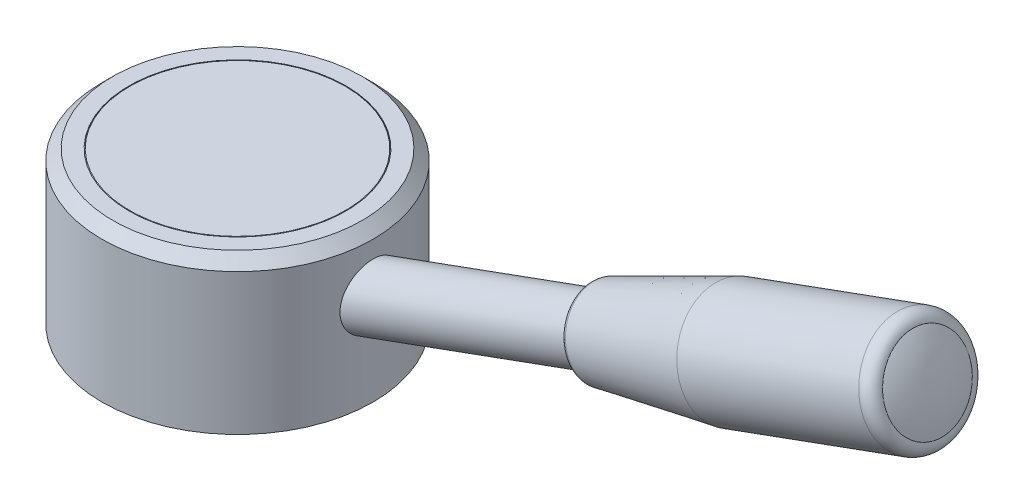
ISO-10303-21;
HEADER;
FILE_DESCRIPTION(('STEP AP214'),'2;1');
FILE_NAME('part.step','',(''),(''),'','','');
FILE_SCHEMA(('AUTOMOTIVE_DESIGN { 1 0 10303 214 1 1 1 1 }'));
ENDSEC;
DATA;
#1=APPLICATION_CONTEXT('core data for automotive mechanical design processes');
#2=APPLICATION_PROTOCOL_DEFINITION('international standard','automotive_design',2000,#1);
#3=PRODUCT_CONTEXT('',#1,'mechanical');
#4=PRODUCT('Part','Part','',(#3));
#5=PRODUCT_RELATED_PRODUCT_CATEGORY('part','',(#4));
#6=PRODUCT_DEFINITION_FORMATION('','',#4);
#7=PRODUCT_DEFINITION_CONTEXT('part definition',#1,'design');
#8=PRODUCT_DEFINITION('design','',#6,#7);
#9=PRODUCT_DEFINITION_SHAPE('','',#8);
#10=(LENGTH_UNIT() NAMED_UNIT(*) SI_UNIT(.MILLI.,.METRE.));
#11=(NAMED_UNIT(*) PLANE_ANGLE_UNIT() SI_UNIT($,.RADIAN.));
#12=(NAMED_UNIT(*) SI_UNIT($,.STERADIAN.) SOLID_ANGLE_UNIT());
#13=UNCERTAINTY_MEASURE_WITH_UNIT(LENGTH_MEASURE(1.E-05),#10,'distance_accuracy_value','');
#14=(GEOMETRIC_REPRESENTATION_CONTEXT(3) GLOBAL_UNCERTAINTY_ASSIGNED_CONTEXT((#13)) GLOBAL_UNIT_ASSIGNED_CONTEXT((#10,
#11,#12)) REPRESENTATION_CONTEXT('',''));
#15=CARTESIAN_POINT('',(0.,0.,0.));
#16=DIRECTION('',(0.,0.,1.));
#17=DIRECTION('',(1.,0.,0.));
#18=AXIS2_PLACEMENT_3D('',#15,#16,#17);
#19=CARTESIAN_POINT('',(269.674388127,117.905310581,0.));
#20=DIRECTION('',(1.,0.,0.));
#21=DIRECTION('',(0.,1.,0.));
#22=AXIS2_PLACEMENT_3D('',#19,#20,#21);
#23=SPHERICAL_SURFACE('',#22,55.);
#24=CARTESIAN_POINT('',(324.674388127,117.905310581,0.));
#25=VERTEX_POINT('',#24);
#26=VERTEX_LOOP('',#25);
#27=FACE_BOUND('',#26,.T.);
#28=CARTESIAN_POINT('',(317.972441286322,135.484364303293,0.));
#29=DIRECTION('',(0.939692620785813,0.342020143325932,0.));
#30=DIRECTION('',(0.,0.,1.));
#31=AXIS2_PLACEMENT_3D('',#28,#29,#30);
#32=CIRCLE('',#31,19.5774086941354);
#33=CARTESIAN_POINT('',(317.972441286322,135.484364303293,19.5774086941354));
#34=VERTEX_POINT('',#33);
#35=EDGE_CURVE('E51',#34,#34,#32,.F.);
#36=ORIENTED_EDGE('',*,*,#35,.F.);
#37=EDGE_LOOP('',(#36));
#38=FACE_BOUND('',#37,.T.);
#39=ADVANCED_FACE('F16',(#27,#38),#23,.T.);
#40=CARTESIAN_POINT('',(312.804131872,133.603253515,0.));
#41=DIRECTION('',(0.939692620785813,0.342020143325932,0.));
#42=DIRECTION('',(0.,0.,1.));
#43=AXIS2_PLACEMENT_3D('',#40,#41,#42);
#44=TOROIDAL_SURFACE('',#43,19.5774086949,5.5);
#45=ORIENTED_EDGE('',*,*,#35,.T.);
#46=EDGE_LOOP('',(#45));
#47=FACE_BOUND('',#46,.T.);
#48=CARTESIAN_POINT('',(312.80413187178,133.603253515603,0.));
#49=DIRECTION('',(-0.939692620785813,-0.342020143325932,0.));
#50=DIRECTION('',(0.342020143325932,-0.939692620785813,0.));
#51=AXIS2_PLACEMENT_3D('',#48,#49,#50);
#52=CIRCLE('',#51,25.0774086949);
#53=CARTESIAN_POINT('',(321.381110787853,110.038197616575,0.));
#54=VERTEX_POINT('',#53);
#55=EDGE_CURVE('E53',#54,#54,#52,.T.);
#56=ORIENTED_EDGE('',*,*,#55,.F.);
#57=EDGE_LOOP('',(#56));
#58=FACE_BOUND('',#57,.T.);
#59=ADVANCED_FACE('F48',(#47,#58),#44,.T.);
#60=CARTESIAN_POINT('',(23.4375,64.5,0.));
#61=DIRECTION('',(0.,-1.,0.));
#62=DIRECTION('',(0.,0.,-1.));
#63=AXIS2_PLACEMENT_3D('',#60,#61,#62);
#64=PLANE('',#63);
#65=CARTESIAN_POINT('',(0.,64.5000000009,0.));
#66=DIRECTION('',(0.,-1.,0.));
#67=DIRECTION('',(0.,0.,-1.));
#68=AXIS2_PLACEMENT_3D('',#65,#66,#67);
#69=CIRCLE('',#68,46.875);
#70=CARTESIAN_POINT('',(0.,64.5000000009,-46.875));
#71=VERTEX_POINT('',#70);
#72=EDGE_CURVE('E56',#71,#71,#69,.T.);
#73=ORIENTED_EDGE('',*,*,#72,.T.);
#74=EDGE_LOOP('',(#73));
#75=FACE_BOUND('',#74,.T.);
#76=ADVANCED_FACE('F112',(#75),#64,.T.);
#77=CARTESIAN_POINT('',(24.825,70.,0.));
#78=DIRECTION('',(0.,1.,0.));
#79=DIRECTION('',(0.,0.,1.));
#80=AXIS2_PLACEMENT_3D('',#77,#78,#79);
#81=PLANE('',#80);
#82=CARTESIAN_POINT('',(0.,70.,0.));
#83=DIRECTION('',(0.,-1.,0.));
#84=DIRECTION('',(0.,0.,-1.));
#85=AXIS2_PLACEMENT_3D('',#82,#83,#84);
#86=CIRCLE('',#85,49.65);
#87=CARTESIAN_POINT('',(0.,70.,-49.65));
#88=VERTEX_POINT('',#87);
#89=EDGE_CURVE('E107',#88,#88,#86,.T.);
#90=ORIENTED_EDGE('',*,*,#89,.F.);
#91=EDGE_LOOP('',(#90));
#92=FACE_BOUND('',#91,.T.);
#93=ADVANCED_FACE('F115',(#92),#81,.T.);
#94=CARTESIAN_POINT('',(270.878747769,118.343661642,0.));
#95=DIRECTION('',(-0.939692620785813,-0.342020143325932,0.));
#96=DIRECTION('',(0.342020143325932,-0.939692620785813,0.));
#97=AXIS2_PLACEMENT_3D('',#94,#95,#96);
#98=CYLINDRICAL_SURFACE('',#97,25.0774086949);
#99=CARTESIAN_POINT('',(228.953363666027,103.084069768077,0.));
#100=DIRECTION('',(0.939692620785813,0.342020143325932,0.));
#101=DIRECTION('',(0.342020143325929,-0.939692620785814,0.));
#102=AXIS2_PLACEMENT_3D('',#99,#100,#101);
#103=CIRCLE('',#102,25.0774086948588);
#104=CARTESIAN_POINT('',(237.530342582085,79.519013869088,0.));
#105=VERTEX_POINT('',#104);
#106=EDGE_CURVE('E104',#105,#105,#103,.F.);
#107=ORIENTED_EDGE('',*,*,#106,.F.);
#108=EDGE_LOOP('',(#107));
#109=FACE_BOUND('',#108,.T.);
#110=ORIENTED_EDGE('',*,*,#55,.T.);
#111=EDGE_LOOP('',(#110));
#112=FACE_BOUND('',#111,.T.);
#113=ADVANCED_FACE('F119',(#109,#112),#98,.T.);
#114=CARTESIAN_POINT('',(0.,59.75,0.));
#115=DIRECTION('',(0.,-1.,0.));
#116=DIRECTION('',(0.,0.,-1.));
#117=AXIS2_PLACEMENT_3D('',#114,#115,#116);
#118=CYLINDRICAL_SURFACE('',#117,46.875);
#119=CARTESIAN_POINT('',(0.,54.9999999991,0.));
#120=DIRECTION('',(0.,-1.,0.));
#121=DIRECTION('',(0.,0.,-1.));
#122=AXIS2_PLACEMENT_3D('',#119,#120,#121);
#123=CIRCLE('',#122,46.875);
#124=CARTESIAN_POINT('',(0.,54.9999999991,-46.875));
#125=VERTEX_POINT('',#124);
#126=EDGE_CURVE('E103',#125,#125,#123,.F.);
#127=ORIENTED_EDGE('',*,*,#126,.F.);
#128=EDGE_LOOP('',(#127));
#129=FACE_BOUND('',#128,.T.);
#130=ORIENTED_EDGE('',*,*,#72,.F.);
#131=EDGE_LOOP('',(#130));
#132=FACE_BOUND('',#131,.T.);
#133=ADVANCED_FACE('F123',(#129,#132),#118,.F.);
#134=CARTESIAN_POINT('',(0.,69.65,0.));
#135=DIRECTION('',(0.,-1.,0.));
#136=DIRECTION('',(0.,0.,-1.));
#137=AXIS2_PLACEMENT_3D('',#134,#135,#136);
#138=CONICAL_SURFACE('',#137,50.,0.785398163396992);
#139=ORIENTED_EDGE('',*,*,#89,.T.);
#140=EDGE_LOOP('',(#139));
#141=FACE_BOUND('',#140,.T.);
#142=CARTESIAN_POINT('',(0.,69.65,0.));
#143=DIRECTION('',(0.,-1.,0.));
#144=DIRECTION('',(0.,0.,-1.));
#145=AXIS2_PLACEMENT_3D('',#142,#143,#144);
#146=CIRCLE('',#145,50.);
#147=CARTESIAN_POINT('',(0.,69.65,-50.));
#148=VERTEX_POINT('',#147);
#149=EDGE_CURVE('E100',#148,#148,#146,.F.);
#150=ORIENTED_EDGE('',*,*,#149,.T.);
#151=EDGE_LOOP('',(#150));
#152=FACE_BOUND('',#151,.T.);
#153=ADVANCED_FACE('F127',(#141,#152),#138,.T.);
#154=CARTESIAN_POINT('',(228.953363666027,103.084069768077,0.));
#155=DIRECTION('',(0.939692620785812,0.342020143325933,0.));
#156=DIRECTION('',(-0.342020143325933,0.939692620785812,0.));
#157=AXIS2_PLACEMENT_3D('',#154,#155,#156);
#158=CONICAL_SURFACE('',#157,25.0774086948588,0.104719755120001);
#159=CARTESIAN_POINT('',(170.761101380654,81.9038184312982,0.));
#160=DIRECTION('',(0.939692620785813,0.342020143325932,0.));
#161=DIRECTION('',(0.,0.,-1.));
#162=AXIS2_PLACEMENT_3D('',#159,#160,#161);
#163=CIRCLE('',#162,18.5686279609805);
#164=CARTESIAN_POINT('',(170.761101380654,81.9038184312982,-18.5686279609805));
#165=VERTEX_POINT('',#164);
#166=EDGE_CURVE('E91',#165,#165,#163,.F.);
#167=ORIENTED_EDGE('',*,*,#166,.F.);
#168=EDGE_LOOP('',(#167));
#169=FACE_BOUND('',#168,.T.);
#170=ORIENTED_EDGE('',*,*,#106,.T.);
#171=EDGE_LOOP('',(#170));
#172=FACE_BOUND('',#171,.T.);
#173=ADVANCED_FACE('F131',(#169,#172),#158,.T.);
#174=CARTESIAN_POINT('',(32.1875,55.,0.));
#175=DIRECTION('',(0.,1.,0.));
#176=DIRECTION('',(0.,0.,1.));
#177=AXIS2_PLACEMENT_3D('',#174,#175,#176);
#178=PLANE('',#177);
#179=CARTESIAN_POINT('',(0.,55.,0.));
#180=DIRECTION('',(0.,-1.,0.));
#181=DIRECTION('',(0.,0.,-1.));
#182=AXIS2_PLACEMENT_3D('',#179,#180,#181);
#183=CIRCLE('',#182,17.5);
#184=CARTESIAN_POINT('',(0.,55.,-17.5));
#185=VERTEX_POINT('',#184);
#186=EDGE_CURVE('E99',#185,#185,#183,.T.);
#187=ORIENTED_EDGE('',*,*,#186,.T.);
#188=EDGE_LOOP('',(#187));
#189=FACE_BOUND('',#188,.T.);
#190=ORIENTED_EDGE('',*,*,#126,.T.);
#191=EDGE_LOOP('',(#190));
#192=FACE_BOUND('',#191,.T.);
#193=ADVANCED_FACE('F134',(#189,#192),#178,.T.);
#194=CARTESIAN_POINT('',(0.,69.825,0.));
#195=DIRECTION('',(0.,-1.,0.));
#196=DIRECTION('',(0.,0.,-1.));
#197=AXIS2_PLACEMENT_3D('',#194,#195,#196);
#198=CYLINDRICAL_SURFACE('',#197,50.);
#199=ORIENTED_EDGE('',*,*,#149,.F.);
#200=EDGE_LOOP('',(#199));
#201=FACE_BOUND('',#200,.T.);
#202=CARTESIAN_POINT('',(0.,70.0000000007,0.));
#203=DIRECTION('',(0.,-1.,0.));
#204=DIRECTION('',(0.,0.,-1.));
#205=AXIS2_PLACEMENT_3D('',#202,#203,#204);
#206=CIRCLE('',#205,50.);
#207=CARTESIAN_POINT('',(0.,70.0000000007,-50.));
#208=VERTEX_POINT('',#207);
#209=EDGE_CURVE('E178',#208,#208,#206,.T.);
#210=ORIENTED_EDGE('',*,*,#209,.F.);
#211=EDGE_LOOP('',(#210));
#212=FACE_BOUND('',#211,.T.);
#213=ADVANCED_FACE('F76',(#201,#212),#198,.F.);
#214=CARTESIAN_POINT('',(171.006662945,81.9931955314,0.));
#215=DIRECTION('',(0.939692620785813,0.342020143325932,0.));
#216=DIRECTION('',(0.,0.,-1.));
#217=AXIS2_PLACEMENT_3D('',#214,#215,#216);
#218=TOROIDAL_SURFACE('',#217,16.0823232226,2.5);
#219=CARTESIAN_POINT('',(174.157909886573,66.0257047159085,0.));
#220=CARTESIAN_POINT('',(174.157911795728,66.025699470548,-0.263146664111092));
#221=CARTESIAN_POINT('',(174.155700988608,66.0317736131892,-0.526292853249264));
#222=CARTESIAN_POINT('',(174.146867650066,66.0560430113705,-1.05195154336094));
#223=CARTESIAN_POINT('',(174.140245118645,66.0742382669106,-1.31446404433444));
#224=CARTESIAN_POINT('',(174.122602039749,66.1227122277853,-1.83822261989782));
#225=CARTESIAN_POINT('',(174.111581492276,66.1529909331199,-2.0994686944877));
#226=CARTESIAN_POINT('',(174.085169532556,66.2255571960535,-2.62006513905099));
#227=CARTESIAN_POINT('',(174.06977812031,66.2678447536525,-2.8794155090244));
#228=CARTESIAN_POINT('',(174.03466134905,66.3643272897323,-3.39559572343464));
#229=CARTESIAN_POINT('',(174.014935990037,66.4185222682132,-3.65242556787148));
#230=CARTESIAN_POINT('',(173.971198888567,66.5386889668926,-4.16294601182406));
#231=CARTESIAN_POINT('',(173.947187146112,66.6046606870911,-4.4166366113398));
#232=CARTESIAN_POINT('',(173.894935112572,66.7482219693627,-4.92026740091228));
#233=CARTESIAN_POINT('',(173.866694821487,66.8258115314358,-5.17020759096902));
#234=CARTESIAN_POINT('',(173.806053727127,66.9924215688822,-5.66573543425908));
#235=CARTESIAN_POINT('',(173.773652923851,67.0814420442555,-5.9113230874924));
#236=CARTESIAN_POINT('',(173.704768860648,67.2706994524637,-6.39755421484863));
#237=CARTESIAN_POINT('',(173.668285600722,67.3709363852986,-6.63819768897154));
#238=CARTESIAN_POINT('',(173.591324515812,67.5823852282672,-7.11396072693192));
#239=CARTESIAN_POINT('',(173.550846690827,67.6935971384008,-7.34908029076938));
#240=CARTESIAN_POINT('',(173.465993990366,67.9267280168983,-7.81322908452693));
#241=CARTESIAN_POINT('',(173.421619114889,68.0486469852622,-8.04225831444703));
#242=CARTESIAN_POINT('',(173.32907921642,68.3028982667025,-8.49367468889669));
#243=CARTESIAN_POINT('',(173.280914193429,68.435230579779,-8.71606183342625));
#244=CARTESIAN_POINT('',(173.180910033686,68.7099897505232,-9.15365828698423));
#245=CARTESIAN_POINT('',(173.129070896935,68.852416608191,-9.36886759601264));
#246=CARTESIAN_POINT('',(173.021843394695,69.1470217493394,-9.79158992049294));
#247=CARTESIAN_POINT('',(172.966455029206,69.29920003282,-9.99910293594482));
#248=CARTESIAN_POINT('',(172.852262504915,69.6129414147809,-10.4059327562418));
#249=CARTESIAN_POINT('',(172.793458346112,69.7745045132612,-10.6052495610868));
#250=CARTESIAN_POINT('',(172.672575899562,70.1066263055656,-10.9952067885292));
#251=CARTESIAN_POINT('',(172.610497611815,70.2771849993897,-11.1858472111265));
#252=CARTESIAN_POINT('',(172.483216459408,70.6268870915493,-11.5579924045972));
#253=CARTESIAN_POINT('',(172.418013594748,70.8060304898848,-11.7394971754705));
#254=CARTESIAN_POINT('',(172.284640367929,71.1724704189294,-12.0929338046024));
#255=CARTESIAN_POINT('',(172.21647000577,71.3597669496385,-12.2648656628608));
#256=CARTESIAN_POINT('',(172.077326012324,71.7420619296826,-12.5987422678567));
#257=CARTESIAN_POINT('',(172.006352381038,71.9370603790177,-12.760687014594));
#258=CARTESIAN_POINT('',(171.861772831034,72.3342894279694,-13.0741992574689));
#259=CARTESIAN_POINT('',(171.788166912316,72.5365200275861,-13.2257667536065));
#260=CARTESIAN_POINT('',(171.638500110552,72.9477261858734,-13.5181593559045));
#261=CARTESIAN_POINT('',(171.562439227507,73.1567017445441,-13.658984462065));
#262=CARTESIAN_POINT('',(171.408045734418,73.5808943805139,-13.9295530244057));
#263=CARTESIAN_POINT('',(171.329713124376,73.796111457813,-14.059296480586));
#264=CARTESIAN_POINT('',(171.170964887411,74.2322686542519,-14.3073891795696));
#265=CARTESIAN_POINT('',(171.090549260489,74.4532087733917,-14.4257384223728));
#266=CARTESIAN_POINT('',(170.927828718057,74.9002797894048,-14.6507575810847));
#267=CARTESIAN_POINT('',(170.845523802547,75.126410686278,-14.7574274969933));
#268=CARTESIAN_POINT('',(170.679222962679,75.5833184886509,-14.9588310240941));
#269=CARTESIAN_POINT('',(170.595227038321,75.8140953941505,-15.0535646352863));
#270=CARTESIAN_POINT('',(170.425746534337,76.2797392518847,-15.2308673338175));
#271=CARTESIAN_POINT('',(170.34026195471,76.5146062041193,-15.3134364211565));
#272=CARTESIAN_POINT('',(170.168010079877,76.9878643406826,-15.4662111467474));
#273=CARTESIAN_POINT('',(170.08124278467,77.2262555250112,-15.5364167849994));
#274=CARTESIAN_POINT('',(169.906634509257,77.705987818956,-15.6642955147352));
#275=CARTESIAN_POINT('',(169.818793529052,77.9473289285722,-15.7219686062191));
#276=CARTESIAN_POINT('',(169.642249498137,78.4323796670522,-15.8246431765568));
#277=CARTESIAN_POINT('',(169.553546447426,78.676089295916,-15.8696446554106));
#278=CARTESIAN_POINT('',(169.37549197684,79.1652899332833,-15.9468680594654));
#279=CARTESIAN_POINT('',(169.286140556965,79.4107809417869,-15.9790899846664));
#280=CARTESIAN_POINT('',(169.107004573881,79.9029530103218,-16.0306748963823));
#281=CARTESIAN_POINT('',(169.017220010672,80.1496340703532,-16.050037882897));
#282=CARTESIAN_POINT('',(168.837434150137,80.6435916625086,-16.0758648370018));
#283=CARTESIAN_POINT('',(168.747432852812,80.8908681946326,-16.0823288045917));
#284=CARTESIAN_POINT('',(168.657431393035,81.1381451730852,-16.0823232226));
#285=B_SPLINE_CURVE_WITH_KNOTS('',3,(#219,#220,#221,#222,#223,#224,#225,#226,#227,#228,#229,
#230,#231,#232,#233,#234,#235,#236,#237,#238,#239,#240,#241,#242,#243,#244,#245,#246,#247,#248,
#249,#250,#251,#252,#253,#254,#255,#256,#257,#258,#259,#260,#261,#262,#263,#264,#265,#266,#267,
#268,#269,#270,#271,#272,#273,#274,#275,#276,#277,#278,#279,#280,#281,#282,#283,#284),
.UNSPECIFIED.,.F.,.F.,(4,2,2,2,2,2,2,2,2,2,2,2,2,2,2,2,2,2,2,2,2,2,2,2,2,2,2,2,2,2,2,2,4),(0.,
0.789359938760412,1.57871987752115,2.3680798162822,3.15743975504357,3.94679969380524,
4.73615963256722,5.52551957132953,6.31487951009215,7.10423944885509,7.89359938761835,
8.68295932638191,9.47231926514578,10.26167920391,11.0510391426745,11.8403990814393,
12.6297590202045,13.4191189589699,14.2084788977357,14.9978388365018,15.7871987752682,
16.5765587140349,17.3659186528019,18.1552785915692,18.9446385303369,19.7339984691049,
20.5233584078732,21.3127183466418,22.1020782854107,22.8914382241799,23.6807981629495,
24.4701581017193,25.2595180404895),.UNSPECIFIED.);
#286=CARTESIAN_POINT('',(168.657431392958,81.1381451730736,-16.0823232225589));
#287=VERTEX_POINT('',#286);
#288=CARTESIAN_POINT('',(174.1579098865,66.0257047158275,0.));
#289=VERTEX_POINT('',#288);
#290=EDGE_CURVE('E43',#287,#289,#285,.F.);
#291=ORIENTED_EDGE('',*,*,#290,.F.);
#292=CARTESIAN_POINT('',(168.657431393035,81.1381451730852,0.));
#293=DIRECTION('',(0.939692620785813,0.342020143325932,0.));
#294=DIRECTION('',(0.,0.,-1.));
#295=AXIS2_PLACEMENT_3D('',#292,#293,#294);
#296=CIRCLE('',#295,16.0823232226);
#297=CARTESIAN_POINT('',(168.657431392956,81.1381451730785,16.0823232226));
#298=VERTEX_POINT('',#297);
#299=EDGE_CURVE('E37',#298,#287,#296,.F.);
#300=ORIENTED_EDGE('',*,*,#299,.F.);
#301=CARTESIAN_POINT('',(168.657431393027,81.1381451731096,16.0823232226));
#302=CARTESIAN_POINT('',(168.747432852803,80.8908681946567,16.0823288045922));
#303=CARTESIAN_POINT('',(168.837434150129,80.6435916625324,16.0758648370026));
#304=CARTESIAN_POINT('',(169.017220010663,80.1496340703765,16.0500378828987));
#305=CARTESIAN_POINT('',(169.107004573872,79.9029530103448,16.0306748963843));
#306=CARTESIAN_POINT('',(169.286140556957,79.4107809418093,15.9790899846692));
#307=CARTESIAN_POINT('',(169.375491976832,79.1652899333055,15.9468680594685));
#308=CARTESIAN_POINT('',(169.553546447418,78.6760892959376,15.8696446554144));
#309=CARTESIAN_POINT('',(169.642249498129,78.4323796670734,15.8246431765609));
#310=CARTESIAN_POINT('',(169.818793529045,77.9473289285928,15.7219686062239));
#311=CARTESIAN_POINT('',(169.90663450925,77.7059878189763,15.6642955147403));
#312=CARTESIAN_POINT('',(170.081242784663,77.2262555250308,15.536416785005));
#313=CARTESIAN_POINT('',(170.16801007987,76.9878643407019,15.4662111467533));
#314=CARTESIAN_POINT('',(170.340261954704,76.514606204138,15.3134364211628));
#315=CARTESIAN_POINT('',(170.42574653433,76.279739251903,15.2308673338241));
#316=CARTESIAN_POINT('',(170.595227038315,75.8140953941681,15.0535646352933));
#317=CARTESIAN_POINT('',(170.679222962673,75.5833184886682,14.9588310241014));
#318=CARTESIAN_POINT('',(170.845523802541,75.1264106862946,14.757427497001));
#319=CARTESIAN_POINT('',(170.927828718051,74.900279789421,14.6507575810925));
#320=CARTESIAN_POINT('',(171.090549260483,74.4532087734072,14.425738422381));
#321=CARTESIAN_POINT('',(171.170964887405,74.2322686542671,14.3073891795779));
#322=CARTESIAN_POINT('',(171.32971312437,73.7961114578275,14.0592964805945));
#323=CARTESIAN_POINT('',(171.408045734413,73.580894380528,13.9295530244144));
#324=CARTESIAN_POINT('',(171.562439227502,73.1567017445575,13.6589844620738));
#325=CARTESIAN_POINT('',(171.638500110547,72.9477261858865,13.5181593559134));
#326=CARTESIAN_POINT('',(171.788166912311,72.5365200275984,13.2257667536156));
#327=CARTESIAN_POINT('',(171.86177283103,72.3342894279814,13.0741992574781));
#328=CARTESIAN_POINT('',(172.006352381034,71.937060379029,12.7606870146032));
#329=CARTESIAN_POINT('',(172.07732601232,71.7420619296936,12.5987422678659));
#330=CARTESIAN_POINT('',(172.216470005766,71.3597669496487,12.2648656628701));
#331=CARTESIAN_POINT('',(172.284640367926,71.1724704189393,12.0929338046116));
#332=CARTESIAN_POINT('',(172.418013594745,70.806030489894,11.7394971754798));
#333=CARTESIAN_POINT('',(172.483216459405,70.6268870915582,11.5579924046064));
#334=CARTESIAN_POINT('',(172.610497611812,70.277184999398,11.1858472111357));
#335=CARTESIAN_POINT('',(172.672575899559,70.1066263055735,10.9952067885383));
#336=CARTESIAN_POINT('',(172.793458346109,69.7745045132686,10.6052495610958));
#337=CARTESIAN_POINT('',(172.852262504912,69.612941414788,10.4059327562506));
#338=CARTESIAN_POINT('',(172.966455029204,69.2992000328265,9.99910293595351));
#339=CARTESIAN_POINT('',(173.021843394693,69.1470217493456,9.79158992050153));
#340=CARTESIAN_POINT('',(173.129070896933,68.8524166081966,9.36886759602101));
#341=CARTESIAN_POINT('',(173.180910033684,68.7099897505285,9.15365828699247));
#342=CARTESIAN_POINT('',(173.280914193427,68.4352305797838,8.71606183343421));
#343=CARTESIAN_POINT('',(173.329079216419,68.302898266707,8.4936746889045));
#344=CARTESIAN_POINT('',(173.421619114887,68.0486469852662,8.04225831445452));
#345=CARTESIAN_POINT('',(173.465993990364,67.9267280169021,7.81322908453426));
#346=CARTESIAN_POINT('',(173.550846690826,67.6935971384042,7.34908029077635));
#347=CARTESIAN_POINT('',(173.59132451581,67.5823852282703,7.11396072693871));
#348=CARTESIAN_POINT('',(173.668285600721,67.3709363853013,6.63819768897795));
#349=CARTESIAN_POINT('',(173.704768860647,67.2706994524662,6.39755421485484));
#350=CARTESIAN_POINT('',(173.77365292385,67.0814420442576,5.91132308749819));
#351=CARTESIAN_POINT('',(173.806053727126,66.9924215688842,5.66573543426466));
#352=CARTESIAN_POINT('',(173.866694821487,66.8258115314374,5.17020759097415));
#353=CARTESIAN_POINT('',(173.894935112571,66.7482219693642,4.92026740091718));
#354=CARTESIAN_POINT('',(173.947187146111,66.6046606870923,4.41663661134423));
#355=CARTESIAN_POINT('',(173.971198888567,66.5386889668937,4.16294601182825));
#356=CARTESIAN_POINT('',(174.014935990036,66.418522268214,3.65242556787517));
#357=CARTESIAN_POINT('',(174.03466134905,66.364327289733,3.39559572343807));
#358=CARTESIAN_POINT('',(174.06977812031,66.267844753653,2.87941550902732));
#359=CARTESIAN_POINT('',(174.085169532556,66.2255571960539,2.62006513905366));
#360=CARTESIAN_POINT('',(174.111581492275,66.1529909331202,2.09946869448986));
#361=CARTESIAN_POINT('',(174.122602039749,66.1227122277855,1.83822261989971));
#362=CARTESIAN_POINT('',(174.140245118645,66.0742382669107,1.31446404433579));
#363=CARTESIAN_POINT('',(174.146867650066,66.0560430113706,1.05195154336203));
#364=CARTESIAN_POINT('',(174.155700988608,66.0317736131892,0.526292853249822));
#365=CARTESIAN_POINT('',(174.157911795728,66.025699470548,0.263146664111373));
#366=CARTESIAN_POINT('',(174.157909886573,66.0257047159085,0.));
#367=B_SPLINE_CURVE_WITH_KNOTS('',3,(#301,#302,#303,#304,#305,#306,#307,#308,#309,#310,#311,
#312,#313,#314,#315,#316,#317,#318,#319,#320,#321,#322,#323,#324,#325,#326,#327,#328,#329,#330,
#331,#332,#333,#334,#335,#336,#337,#338,#339,#340,#341,#342,#343,#344,#345,#346,#347,#348,#349,
#350,#351,#352,#353,#354,#355,#356,#357,#358,#359,#360,#361,#362,#363,#364,#365,#366),
.UNSPECIFIED.,.F.,.F.,(4,2,2,2,2,2,2,2,2,2,2,2,2,2,2,2,2,2,2,2,2,2,2,2,2,2,2,2,2,2,2,2,4),(0.,
0.78935993877099,1.57871987754166,2.36807981631202,3.15743975508206,3.94679969385179,
4.73615963262121,5.52551957139031,6.31487951015909,7.10423944892756,7.89359938769571,
8.68295932646356,9.47231926523108,10.2616792039983,11.0510391427652,11.8403990815318,
12.629759020298,13.419118959064,14.2084788978296,14.9978388365949,15.7871987753599,
16.5765587141246,17.365918652889,18.1552785916531,18.9446385304168,19.7339984691802,
20.5233584079434,21.3127183467062,22.1020782854687,22.8914382242308,23.6807981629927,
24.4701581017542,25.2595180405154),.UNSPECIFIED.);
#368=EDGE_CURVE('E61',#289,#298,#367,.F.);
#369=ORIENTED_EDGE('',*,*,#368,.F.);
#370=EDGE_LOOP('',(#291,#300,#369));
#371=FACE_BOUND('',#370,.T.);
#372=ORIENTED_EDGE('',*,*,#166,.T.);
#373=EDGE_LOOP('',(#372));
#374=FACE_BOUND('',#373,.T.);
#375=ADVANCED_FACE('F64',(#371,#374),#218,.T.);
#376=CARTESIAN_POINT('',(0.,27.5,0.));
#377=DIRECTION('',(0.,-1.,0.));
#378=DIRECTION('',(0.,0.,-1.));
#379=AXIS2_PLACEMENT_3D('',#376,#377,#378);
#380=CYLINDRICAL_SURFACE('',#379,17.5);
#381=CARTESIAN_POINT('',(0.,0.,0.));
#382=DIRECTION('',(0.,-1.,0.));
#383=DIRECTION('',(0.,0.,-1.));
#384=AXIS2_PLACEMENT_3D('',#381,#382,#383);
#385=CIRCLE('',#384,17.5);
#386=CARTESIAN_POINT('',(0.,0.,-17.5));
#387=VERTEX_POINT('',#386);
#388=EDGE_CURVE('E175',#387,#387,#385,.F.);
#389=ORIENTED_EDGE('',*,*,#388,.F.);
#390=EDGE_LOOP('',(#389));
#391=FACE_BOUND('',#390,.T.);
#392=ORIENTED_EDGE('',*,*,#186,.F.);
#393=EDGE_LOOP('',(#392));
#394=FACE_BOUND('',#393,.T.);
#395=ADVANCED_FACE('F75',(#391,#394),#380,.F.);
#396=CARTESIAN_POINT('',(53.75,70.,0.));
#397=DIRECTION('',(0.,1.,0.));
#398=DIRECTION('',(0.,0.,1.));
#399=AXIS2_PLACEMENT_3D('',#396,#397,#398);
#400=PLANE('',#399);
#401=ORIENTED_EDGE('',*,*,#209,.T.);
#402=EDGE_LOOP('',(#401));
#403=FACE_BOUND('',#402,.T.);
#404=CARTESIAN_POINT('',(0.,70.0000000000011,0.));
#405=DIRECTION('',(0.,-1.,0.));
#406=DIRECTION('',(0.,0.,-1.));
#407=AXIS2_PLACEMENT_3D('',#404,#405,#406);
#408=CIRCLE('',#407,57.5000000000011);
#409=CARTESIAN_POINT('',(0.,70.0000000000011,-57.5000000000011));
#410=VERTEX_POINT('',#409);
#411=EDGE_CURVE('E172',#410,#410,#408,.T.);
#412=ORIENTED_EDGE('',*,*,#411,.F.);
#413=EDGE_LOOP('',(#412));
#414=FACE_BOUND('',#413,.T.);
#415=ADVANCED_FACE('F194',(#403,#414),#400,.T.);
#416=CARTESIAN_POINT('',(173.759059125,67.1215381765,0.));
#417=DIRECTION('',(-0.939692620785813,-0.342020143325932,0.));
#418=DIRECTION('',(0.342020143325932,-0.939692620785813,0.));
#419=AXIS2_PLACEMENT_3D('',#416,#417,#418);
#420=PLANE('',#419);
#421=CARTESIAN_POINT('',(168.657431393739,81.1381451734748,0.));
#422=DIRECTION('',(-0.939692620785813,-0.342020143325932,0.));
#423=DIRECTION('',(0.342020143325932,-0.939692620785813,0.));
#424=AXIS2_PLACEMENT_3D('',#421,#422,#423);
#425=CIRCLE('',#424,13.75);
#426=CARTESIAN_POINT('',(173.360208364471,68.2173716376699,0.));
#427=VERTEX_POINT('',#426);
#428=EDGE_CURVE('E169',#427,#427,#425,.T.);
#429=ORIENTED_EDGE('',*,*,#428,.F.);
#430=EDGE_LOOP('',(#429));
#431=FACE_BOUND('',#430,.T.);
#432=ORIENTED_EDGE('',*,*,#368,.T.);
#433=ORIENTED_EDGE('',*,*,#299,.T.);
#434=ORIENTED_EDGE('',*,*,#290,.T.);
#435=EDGE_LOOP('',(#432,#433,#434));
#436=FACE_BOUND('',#435,.T.);
#437=ADVANCED_FACE('F197',(#431,#436),#420,.T.);
#438=CARTESIAN_POINT('',(40.,0.,0.));
#439=DIRECTION('',(0.,-1.,0.));
#440=DIRECTION('',(0.,0.,-1.));
#441=AXIS2_PLACEMENT_3D('',#438,#439,#440);
#442=PLANE('',#441);
#443=ORIENTED_EDGE('',*,*,#388,.T.);
#444=EDGE_LOOP('',(#443));
#445=FACE_BOUND('',#444,.T.);
#446=CARTESIAN_POINT('',(0.,0.,0.));
#447=DIRECTION('',(0.,-1.,0.));
#448=DIRECTION('',(0.,0.,-1.));
#449=AXIS2_PLACEMENT_3D('',#446,#447,#448);
#450=CIRCLE('',#449,62.5);
#451=CARTESIAN_POINT('',(0.,0.,-62.5));
#452=VERTEX_POINT('',#451);
#453=EDGE_CURVE('E167',#452,#452,#450,.F.);
#454=ORIENTED_EDGE('',*,*,#453,.F.);
#455=EDGE_LOOP('',(#454));
#456=FACE_BOUND('',#455,.T.);
#457=ADVANCED_FACE('F201',(#445,#456),#442,.T.);
#458=CARTESIAN_POINT('',(0.,64.9999999999989,0.));
#459=DIRECTION('',(0.,-1.,0.));
#460=DIRECTION('',(0.,0.,-1.));
#461=AXIS2_PLACEMENT_3D('',#458,#459,#460);
#462=CONICAL_SURFACE('',#461,62.4999999999989,0.785398163397001);
#463=CARTESIAN_POINT('',(0.,65.,0.));
#464=DIRECTION('',(0.,-1.,0.));
#465=DIRECTION('',(0.,0.,-1.));
#466=AXIS2_PLACEMENT_3D('',#463,#464,#465);
#467=CIRCLE('',#466,62.5);
#468=CARTESIAN_POINT('',(0.,65.,-62.5));
#469=VERTEX_POINT('',#468);
#470=EDGE_CURVE('E28',#469,#469,#467,.T.);
#471=ORIENTED_EDGE('',*,*,#470,.F.);
#472=EDGE_LOOP('',(#471));
#473=FACE_BOUND('',#472,.T.);
#474=ORIENTED_EDGE('',*,*,#411,.T.);
#475=EDGE_LOOP('',(#474));
#476=FACE_BOUND('',#475,.T.);
#477=ADVANCED_FACE('F155',(#473,#476),#462,.T.);
#478=CARTESIAN_POINT('',(106.977327211,58.6884232045,0.));
#479=DIRECTION('',(-0.939692620785813,-0.342020143325932,0.));
#480=DIRECTION('',(0.342020143325932,-0.939692620785813,0.));
#481=AXIS2_PLACEMENT_3D('',#478,#479,#480);
#482=CYLINDRICAL_SURFACE('',#481,13.75);
#483=CARTESIAN_POINT('',(60.9687412557336,41.9426767270988,13.7499990800844));
#484=CARTESIAN_POINT('',(60.9687426257937,42.3875487142388,13.7499968227351));
#485=CARTESIAN_POINT('',(60.9730535539408,42.8324805928961,13.730923072656));
#486=CARTESIAN_POINT('',(60.9899900216886,43.7191941931075,13.6554969521441));
#487=CARTESIAN_POINT('',(61.002620026665,44.1609740939924,13.5991245610942));
#488=CARTESIAN_POINT('',(61.0356958824548,45.0392702914998,13.4498948302404));
#489=CARTESIAN_POINT('',(61.0561630249996,45.4757688777674,13.3569380796954));
#490=CARTESIAN_POINT('',(61.104161858935,46.3392988656545,13.1356084998882));
#491=CARTESIAN_POINT('',(61.1316938292276,46.7663298927947,13.0072342724156));
#492=CARTESIAN_POINT('',(61.1928688346438,47.6075423529758,12.716322424893));
#493=CARTESIAN_POINT('',(61.2265042995248,48.0217389678369,12.5538270868826));
#494=CARTESIAN_POINT('',(61.2988670999205,48.8351324191751,12.1955842884355));
#495=CARTESIAN_POINT('',(61.3375953857824,49.2343264381683,11.9998306198242));
#496=CARTESIAN_POINT('',(61.4188483928962,50.0136673895141,11.576757583276));
#497=CARTESIAN_POINT('',(61.4613615645101,50.3938670911931,11.3495331443611));
#498=CARTESIAN_POINT('',(61.5490040997229,51.1334672927531,10.8641999774332));
#499=CARTESIAN_POINT('',(61.5941318579095,51.4928802907745,10.6061100999897));
#500=CARTESIAN_POINT('',(61.6612119998296,52.0023704848764,10.2059563187854));
#501=CARTESIAN_POINT('',(61.682673236317,52.1617557611451,10.0755198720856));
#502=CARTESIAN_POINT('',(61.7257357526884,52.4751208288214,9.80825720428187));
#503=CARTESIAN_POINT('',(61.7473370619297,52.6290994406344,9.67142960378126));
#504=CARTESIAN_POINT('',(61.8089125908473,53.0599237327482,9.27239176587473));
#505=CARTESIAN_POINT('',(61.8488768478496,53.3298055649843,9.00258105624521));
#506=CARTESIAN_POINT('',(61.9278251806845,53.8477270795606,8.44241922753881));
#507=CARTESIAN_POINT('',(61.9668088347727,54.0957574748835,8.15205946860754));
#508=CARTESIAN_POINT('',(62.0428743742065,54.5681026178984,7.55139463670474));
#509=CARTESIAN_POINT('',(62.0799521986103,54.792367724317,7.24104990984139));
#510=CARTESIAN_POINT('',(62.1511169547733,55.2142168786775,6.60241269975828));
#511=CARTESIAN_POINT('',(62.1852041768139,55.4118035171585,6.27412196349159));
#512=CARTESIAN_POINT('',(62.2496120609422,55.7791043426196,5.59923105586522));
#513=CARTESIAN_POINT('',(62.2799079103992,55.9486370420653,5.25252947744449));
#514=CARTESIAN_POINT('',(62.3355243586315,56.2559145366857,4.54512536956079));
#515=CARTESIAN_POINT('',(62.360847758211,56.3936772344469,4.18443085973472));
#516=CARTESIAN_POINT('',(62.4056469280487,56.6351340850997,3.45244052616402));
#517=CARTESIAN_POINT('',(62.4251371020616,56.7389122154902,3.08117333639135));
#518=CARTESIAN_POINT('',(62.4576661361068,56.9110907578311,2.33043045401142));
#519=CARTESIAN_POINT('',(62.4707091390814,56.9795138901342,1.95096019676367));
#520=CARTESIAN_POINT('',(62.4868308598267,57.0638482605407,1.30909363356526));
#521=CARTESIAN_POINT('',(62.4917612339537,57.0895497033626,1.04799029348644));
#522=CARTESIAN_POINT('',(62.4983462155319,57.1238491907293,0.524599852686103));
#523=CARTESIAN_POINT('',(62.5000006373852,57.1324462662325,0.262312685739));
#524=CARTESIAN_POINT('',(62.4999991504672,57.1324418473245,-0.34948876870853));
#525=CARTESIAN_POINT('',(62.4970603711112,57.1171751141935,-0.699022836349758));
#526=CARTESIAN_POINT('',(62.4853905480241,57.0563208698653,-1.39548482078418));
#527=CARTESIAN_POINT('',(62.4766566713099,57.0107185288178,-1.74241137894274));
#528=CARTESIAN_POINT('',(62.4536355030134,56.8897397942328,-2.43156726548594));
#529=CARTESIAN_POINT('',(62.4393369616987,56.8143030813805,-2.77378561524187));
#530=CARTESIAN_POINT('',(62.4056105898449,56.6347480512087,-3.45028627122429));
#531=CARTESIAN_POINT('',(62.3861834159853,56.5306334057909,-3.78456958749897));
#532=CARTESIAN_POINT('',(62.3428345622251,56.2955796649951,-4.44173430608343));
#533=CARTESIAN_POINT('',(62.3189311132903,56.1647491889058,-4.76465585879631));
#534=CARTESIAN_POINT('',(62.2672136911555,55.8775891961179,-5.39863705102761));
#535=CARTESIAN_POINT('',(62.2393993818693,55.7212574877439,-5.70969566816149));
#536=CARTESIAN_POINT('',(62.1805938090432,55.3850076201507,-6.31799299010664));
#537=CARTESIAN_POINT('',(62.1496061616789,55.2051162445294,-6.61524687657688));
#538=CARTESIAN_POINT('',(62.0851679849603,54.8234225800001,-7.19492664613052));
#539=CARTESIAN_POINT('',(62.0517179665144,54.6216248322642,-7.47735558447234));
#540=CARTESIAN_POINT('',(61.9775469660792,54.1635886407974,-8.07074508757291));
#541=CARTESIAN_POINT('',(61.9365240806203,53.9038210764956,-8.37894880654493));
#542=CARTESIAN_POINT('',(61.8533192430959,53.3597782333303,-8.97255516039229));
#543=CARTESIAN_POINT('',(61.8111374984924,53.0755073218954,-9.25796184116684));
#544=CARTESIAN_POINT('',(61.7223482738137,52.4542640394765,-9.83336394556556));
#545=CARTESIAN_POINT('',(61.6757358038142,52.1148839955942,-10.120761634394));
#546=CARTESIAN_POINT('',(61.5838897724437,51.4123481164544,-10.6654045067846));
#547=CARTESIAN_POINT('',(61.5386568857304,51.0491809133774,-10.9226351072849));
#548=CARTESIAN_POINT('',(61.450847423099,50.3012887212392,-11.4063109123918));
#549=CARTESIAN_POINT('',(61.4082778507423,49.9165115595694,-11.6326766550169));
#550=CARTESIAN_POINT('',(61.3272009869125,49.1291417859528,-12.0528090799753));
#551=CARTESIAN_POINT('',(61.2886938059662,48.7265486897054,-12.2465748754371));
#552=CARTESIAN_POINT('',(61.2169435249398,47.9066847186947,-12.6003328224649));
#553=CARTESIAN_POINT('',(61.1836966452615,47.489424648238,-12.7603492511968));
#554=CARTESIAN_POINT('',(61.123478925489,46.6426873386454,-13.0457508787038));
#555=CARTESIAN_POINT('',(61.0965092181531,46.213207910112,-13.1711298276731));
#556=CARTESIAN_POINT('',(61.0498325193715,45.3463151888043,-13.3858127717188));
#557=CARTESIAN_POINT('',(61.030104012642,44.9089295183383,-13.4752237133359));
#558=CARTESIAN_POINT('',(60.9985393452018,44.0281508995831,-13.6173989022904));
#559=CARTESIAN_POINT('',(60.9866983040593,43.5847618395762,-13.6701858118801));
#560=CARTESIAN_POINT('',(60.9756363028237,42.9408394373657,-13.7194008569563));
#561=CARTESIAN_POINT('',(60.9730571889631,42.7414162844684,-13.7308541512625));
#562=CARTESIAN_POINT('',(60.9696095736936,42.3422257816769,-13.7461548353782));
#563=CARTESIAN_POINT('',(60.9687413817872,42.1424583760485,-13.7500008490451));
#564=CARTESIAN_POINT('',(60.9687432255562,41.5380799177349,-13.7499982806346));
#565=CARTESIAN_POINT('',(60.9723072920347,41.1333965923321,-13.734221119044));
#566=CARTESIAN_POINT('',(60.986611909577,40.3265234872953,-13.6705599814323));
#567=CARTESIAN_POINT('',(60.9973559278988,39.924335007195,-13.6226604932357));
#568=CARTESIAN_POINT('',(61.0258910579159,39.1245117119233,-13.4942566451453));
#569=CARTESIAN_POINT('',(61.0436975963025,38.726888838907,-13.4136809016613));
#570=CARTESIAN_POINT('',(61.0859686819236,37.9401069313725,-13.2198433633754));
#571=CARTESIAN_POINT('',(61.1104321697677,37.5509465607597,-13.1065867692481));
#572=CARTESIAN_POINT('',(61.1654769681106,36.7830272605468,-12.8472577352266));
#573=CARTESIAN_POINT('',(61.196073833044,36.4042976189615,-12.7011017431864));
#574=CARTESIAN_POINT('',(61.2625142369792,35.6612425853932,-12.3766614723041));
#575=CARTESIAN_POINT('',(61.2983586738159,35.2969196719092,-12.1983716943122));
#576=CARTESIAN_POINT('',(61.3741543051318,34.5866163173165,-11.8110964332401));
#577=CARTESIAN_POINT('',(61.4140950035326,34.2405922771693,-11.6021888417366));
#578=CARTESIAN_POINT('',(61.4969433016219,33.568881341595,-11.154714788769));
#579=CARTESIAN_POINT('',(61.5398492094576,33.2431830475758,-10.9161651790803));
#580=CARTESIAN_POINT('',(61.6102610938234,32.7372009318603,-10.5095279241239));
#581=CARTESIAN_POINT('',(61.6372508590918,32.549721306361,-10.3502191646695));
#582=CARTESIAN_POINT('',(61.691535674414,32.1838004625002,-10.0215851815225));
#583=CARTESIAN_POINT('',(61.7188307234948,32.0053592153413,-9.85225998974705));
#584=CARTESIAN_POINT('',(61.7882223521207,31.5637797016275,-9.40954038086043));
#585=CARTESIAN_POINT('',(61.8303141955469,31.3072204312691,-9.12952973682363));
#586=CARTESIAN_POINT('',(61.9133125337447,30.8185687971047,-8.54855963692823));
#587=CARTESIAN_POINT('',(61.9542184401119,30.5864884328401,-8.24759002590939));
#588=CARTESIAN_POINT('',(62.0337784434292,30.1479624832175,-7.62618171206553));
#589=CARTESIAN_POINT('',(62.0724271568271,29.9415769542085,-7.30569991142726));
#590=CARTESIAN_POINT('',(62.1462832460575,29.5564561467275,-6.64822376084756));
#591=CARTESIAN_POINT('',(62.1814911352902,29.3777167408928,-6.31123188564936));
#592=CARTESIAN_POINT('',(62.2474908734238,29.0489956999534,-5.62310664971218));
#593=CARTESIAN_POINT('',(62.2782829188119,28.8990127852012,-5.27197391907496));
#594=CARTESIAN_POINT('',(62.3345996954004,28.6287269026546,-4.5580559171627));
#595=CARTESIAN_POINT('',(62.3601244397889,28.5084238605487,-4.1952706750654));
#596=CARTESIAN_POINT('',(62.4051546782364,28.298454283774,-3.46143405671947));
#597=CARTESIAN_POINT('',(62.424673025488,28.2087222848697,-3.09040217918236));
#598=CARTESIAN_POINT('',(62.4572235595397,28.0601017201494,-2.3420839382706));
#599=CARTESIAN_POINT('',(62.4702587925421,28.0011986681422,-1.96480059852605));
#600=CARTESIAN_POINT('',(62.4865591817959,27.9277846871236,-1.32260336122573));
#601=CARTESIAN_POINT('',(62.4915933493315,27.9052055177792,-1.05862741252572));
#602=CARTESIAN_POINT('',(62.498314133117,27.8750904169937,-0.529776670005286));
#603=CARTESIAN_POINT('',(62.5000007522519,27.8675544725883,-0.264901876959702));
#604=CARTESIAN_POINT('',(62.4999989143638,27.8675572964913,0.382301547920306));
#605=CARTESIAN_POINT('',(62.4964834163304,27.8832570371484,0.7646595055135));
#606=CARTESIAN_POINT('',(62.4825112820602,27.9459836000961,1.52682129697839));
#607=CARTESIAN_POINT('',(62.472051366464,27.993025222988,1.90662383847101));
#608=CARTESIAN_POINT('',(62.4444470962494,28.1182949439044,2.6615719049272));
#609=CARTESIAN_POINT('',(62.4272898070103,28.196583395466,3.03670696015451));
#610=CARTESIAN_POINT('',(62.3867534566784,28.3839250152055,3.7790544950262));
#611=CARTESIAN_POINT('',(62.3633715315361,28.4929923466045,4.14626324335984));
#612=CARTESIAN_POINT('',(62.3110323618535,28.7412317509632,4.87000060772143));
#613=CARTESIAN_POINT('',(62.2820744588903,28.8804073794132,5.22652795671645));
#614=CARTESIAN_POINT('',(62.2194030970758,29.1879267289636,5.92614375902079));
#615=CARTESIAN_POINT('',(62.1856918516023,29.3562568826423,6.26923837276804));
#616=CARTESIAN_POINT('',(62.1145144887643,29.7206984490091,6.93904327432354));
#617=CARTESIAN_POINT('',(62.0770558720478,29.9167546789408,7.26578440223265));
#618=CARTESIAN_POINT('',(61.9993875445717,30.3355510754046,7.90115955882237));
#619=CARTESIAN_POINT('',(61.9591791585631,30.558278430945,8.20980217550715));
#620=CARTESIAN_POINT('',(61.890003427163,30.9550944401692,8.71322541614288));
#621=CARTESIAN_POINT('',(61.861466349102,31.1225244852833,8.91335306717658));
#622=CARTESIAN_POINT('',(61.8039970703526,31.4687302015148,9.30348412721306));
#623=CARTESIAN_POINT('',(61.7750648659918,31.6475059781361,9.49348744203948));
#624=CARTESIAN_POINT('',(61.7032811584278,32.1043138953661,9.95146332482024));
#625=CARTESIAN_POINT('',(61.6604174096863,32.3887832827327,10.2130614734126));
#626=CARTESIAN_POINT('',(61.5758698946589,32.979368836178,10.7110273124895));
#627=CARTESIAN_POINT('',(61.5341867219925,33.2854956306785,10.9473824701182));
#628=CARTESIAN_POINT('',(61.4531115671135,33.9177070652543,11.3937110540546));
#629=CARTESIAN_POINT('',(61.4137247289033,34.2438333901887,11.6036263869405));
#630=CARTESIAN_POINT('',(61.3384449317313,34.9129351644288,11.9952050163804));
#631=CARTESIAN_POINT('',(61.3025514591982,35.2559081258655,12.1768724681025));
#632=CARTESIAN_POINT('',(61.235274203381,35.9556179187259,12.5108022281516));
#633=CARTESIAN_POINT('',(61.2038833038656,36.3123318749152,12.6631110712103));
#634=CARTESIAN_POINT('',(61.1463458682781,37.0374559006643,12.9380885399756));
#635=CARTESIAN_POINT('',(61.1201999733516,37.4058673937548,13.0607535424157));
#636=CARTESIAN_POINT('',(61.0738255039821,38.1510415997628,13.2759155268797));
#637=CARTESIAN_POINT('',(61.0535866588253,38.5277885772738,13.3684649041779));
#638=CARTESIAN_POINT('',(61.0194071490045,39.2875391421422,13.5236191131722));
#639=CARTESIAN_POINT('',(61.005464219572,39.6705404282455,13.5862347131308));
#640=CARTESIAN_POINT('',(60.9861090189928,40.368339984335,13.6728217411212));
#641=CARTESIAN_POINT('',(60.9795888876061,40.6824945759213,13.7018309309685));
#642=CARTESIAN_POINT('',(60.9709049357014,41.3119818126369,13.7404185480153));
#643=CARTESIAN_POINT('',(60.9687402845203,41.6273142216415,13.7500006802826));
#644=CARTESIAN_POINT('',(60.9687412557336,41.9426767270988,13.7499990800844));
#645=B_SPLINE_CURVE_WITH_KNOTS('',3,(#483,#484,#485,#486,#487,#488,#489,#490,#491,#492,#493,
#494,#495,#496,#497,#498,#499,#500,#501,#502,#503,#504,#505,#506,#507,#508,#509,#510,#511,#512,
#513,#514,#515,#516,#517,#518,#519,#520,#521,#522,#523,#524,#525,#526,#527,#528,#529,#530,#531,
#532,#533,#534,#535,#536,#537,#538,#539,#540,#541,#542,#543,#544,#545,#546,#547,#548,#549,#550,
#551,#552,#553,#554,#555,#556,#557,#558,#559,#560,#561,#562,#563,#564,#565,#566,#567,#568,#569,
#570,#571,#572,#573,#574,#575,#576,#577,#578,#579,#580,#581,#582,#583,#584,#585,#586,#587,#588,
#589,#590,#591,#592,#593,#594,#595,#596,#597,#598,#599,#600,#601,#602,#603,#604,#605,#606,#607,
#608,#609,#610,#611,#612,#613,#614,#615,#616,#617,#618,#619,#620,#621,#622,#623,#624,#625,#626,
#627,#628,#629,#630,#631,#632,#633,#634,#635,#636,#637,#638,#639,#640,#641,#642,#643,#644),
.UNSPECIFIED.,.T.,.F.,(4,2,2,2,2,2,2,2,2,2,2,2,2,2,2,2,2,2,2,2,2,2,2,2,2,2,2,2,2,2,2,2,2,2,2,2,
2,2,2,2,2,2,2,2,2,2,2,2,2,2,2,2,2,2,2,2,2,2,2,2,2,2,2,2,2,2,2,2,2,2,2,2,2,2,2,2,2,2,2,2,4),(0.,
1.33431145959934,2.66933971298385,4.00802096930112,5.34675508161536,6.68383995540958,
8.02117469125518,9.35455993027398,10.6871349449706,11.3082029910901,11.9294057067733,
13.079306632819,14.2296939408106,15.3824386984689,16.5350714414033,17.6948916692013,
18.8540567255919,20.0103354274939,21.1658701373885,21.9525649740702,22.7393043793808,
23.7875060143183,24.8362204495238,25.8870661111024,26.9377772856556,27.9842986979077,
29.0309100997326,30.0763418346941,31.1215572649068,32.3355469960604,33.5493207937243,
34.8890609748134,36.2294461527247,37.5732195150482,38.9170294284035,40.2598693676972,
41.6029514439972,42.942009974058,44.2802391794862,44.8794181000353,45.4787054010063,
46.6922968355001,47.9064747472014,49.1233195289499,50.3399707745158,51.5597474349993,
52.7797330380095,53.9966672092444,55.2129126799877,55.9550786373966,56.6972422300284,
57.842102847706,58.9875220921873,60.1355701664186,61.2834466797479,62.4312721013678,
63.5790946490722,64.7244435914651,65.8692538624085,66.6637937718546,67.4583329965525,
68.6049974858557,69.7522038495733,70.9016368600745,72.0515996590096,73.2016983313128,
74.351263221901,75.4985715365466,76.6453309564567,77.4323710204462,78.2194184041876,
79.3844210233979,80.5499993902141,81.7180956676177,82.8860199591156,84.0520775340398,
85.2182775602414,86.382437642255,87.546178618044,88.4922307231195,89.438102383111),.UNSPECIFIED.);
#646=CARTESIAN_POINT('',(60.9687412557336,41.9426767270988,13.7499990800844));
#647=VERTEX_POINT('',#646);
#648=EDGE_CURVE('E11',#647,#647,#645,.T.);
#649=ORIENTED_EDGE('',*,*,#648,.F.);
#650=EDGE_LOOP('',(#649));
#651=FACE_BOUND('',#650,.T.);
#652=ORIENTED_EDGE('',*,*,#428,.T.);
#653=EDGE_LOOP('',(#652));
#654=FACE_BOUND('',#653,.T.);
#655=ADVANCED_FACE('F148',(#651,#654),#482,.T.);
#656=CARTESIAN_POINT('',(0.,32.5,0.));
#657=DIRECTION('',(0.,-1.,0.));
#658=DIRECTION('',(0.,0.,-1.));
#659=AXIS2_PLACEMENT_3D('',#656,#657,#658);
#660=CYLINDRICAL_SURFACE('',#659,62.5);
#661=ORIENTED_EDGE('',*,*,#453,.T.);
#662=EDGE_LOOP('',(#661));
#663=FACE_BOUND('',#662,.T.);
#664=ORIENTED_EDGE('',*,*,#470,.T.);
#665=EDGE_LOOP('',(#664));
#666=FACE_BOUND('',#665,.T.);
#667=ORIENTED_EDGE('',*,*,#648,.T.);
#668=EDGE_LOOP('',(#667));
#669=FACE_BOUND('',#668,.T.);
#670=ADVANCED_FACE('F146',(#663,#666,#669),#660,.T.);
#671=CLOSED_SHELL('',(#39,#59,#76,#93,#113,#133,#153,#173,#193,#213,#375,#395,#415,#437,#457,
#477,#655,#670));
#672=MANIFOLD_SOLID_BREP('B1',#671);
#673=ADVANCED_BREP_SHAPE_REPRESENTATION('',(#18,#672),#14);
#674=SHAPE_DEFINITION_REPRESENTATION(#9,#673);
ENDSEC;
END-ISO-10303-21;
